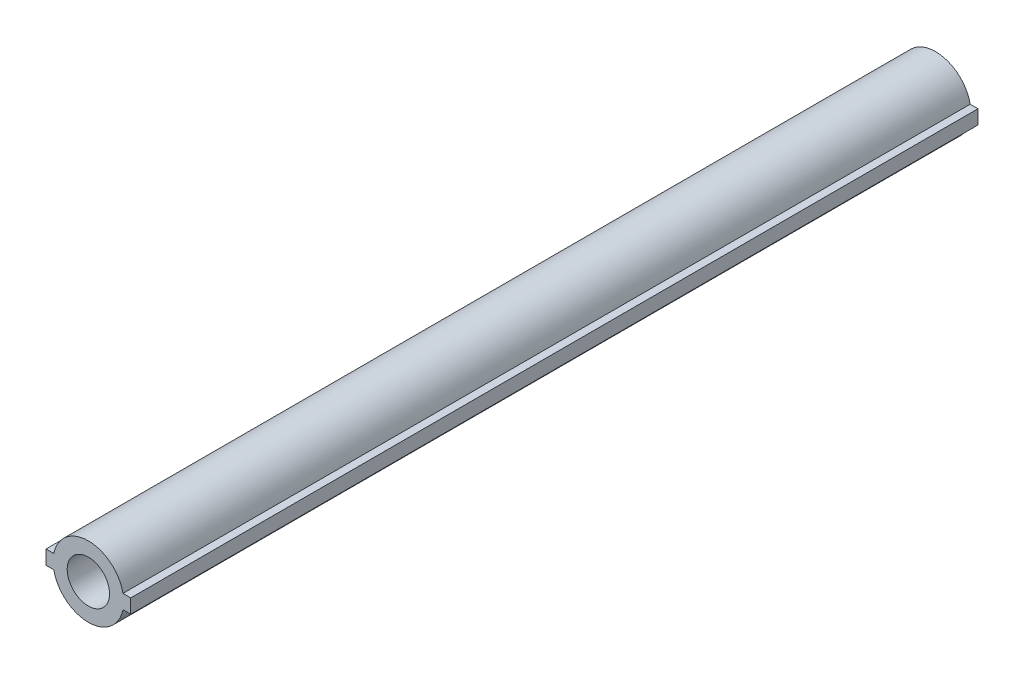
ISO-10303-21;
HEADER;
FILE_DESCRIPTION(('STEP AP214'),'2;1');
FILE_NAME('part.step','',(''),(''),'','','');
FILE_SCHEMA(('AUTOMOTIVE_DESIGN { 1 0 10303 214 1 1 1 1 }'));
ENDSEC;
DATA;
#1=APPLICATION_CONTEXT('core data for automotive mechanical design processes');
#2=APPLICATION_PROTOCOL_DEFINITION('international standard','automotive_design',2000,#1);
#3=PRODUCT_CONTEXT('',#1,'mechanical');
#4=PRODUCT('Part','Part','',(#3));
#5=PRODUCT_RELATED_PRODUCT_CATEGORY('part','',(#4));
#6=PRODUCT_DEFINITION_FORMATION('','',#4);
#7=PRODUCT_DEFINITION_CONTEXT('part definition',#1,'design');
#8=PRODUCT_DEFINITION('design','',#6,#7);
#9=PRODUCT_DEFINITION_SHAPE('','',#8);
#10=(LENGTH_UNIT() NAMED_UNIT(*) SI_UNIT(.MILLI.,.METRE.));
#11=(NAMED_UNIT(*) PLANE_ANGLE_UNIT() SI_UNIT($,.RADIAN.));
#12=(NAMED_UNIT(*) SI_UNIT($,.STERADIAN.) SOLID_ANGLE_UNIT());
#13=UNCERTAINTY_MEASURE_WITH_UNIT(LENGTH_MEASURE(1.E-05),#10,'distance_accuracy_value','');
#14=(GEOMETRIC_REPRESENTATION_CONTEXT(3) GLOBAL_UNCERTAINTY_ASSIGNED_CONTEXT((#13)) GLOBAL_UNIT_ASSIGNED_CONTEXT((#10,
#11,#12)) REPRESENTATION_CONTEXT('',''));
#15=CARTESIAN_POINT('',(0.,0.,0.));
#16=DIRECTION('',(0.,0.,1.));
#17=DIRECTION('',(1.,0.,0.));
#18=AXIS2_PLACEMENT_3D('',#15,#16,#17);
#19=CARTESIAN_POINT('',(0.,0.,18000.));
#20=DIRECTION('',(0.,0.,-1.));
#21=DIRECTION('',(-1.,0.,0.));
#22=AXIS2_PLACEMENT_3D('',#19,#20,#21);
#23=CYLINDRICAL_SURFACE('',#22,750.);
#24=CARTESIAN_POINT('',(0.,0.,18000.));
#25=DIRECTION('',(0.,0.,1.));
#26=DIRECTION('',(1.,0.,0.));
#27=AXIS2_PLACEMENT_3D('',#24,#25,#26);
#28=CIRCLE('',#27,750.);
#29=CARTESIAN_POINT('',(-734.846922834953,-150.,18000.));
#30=VERTEX_POINT('',#29);
#31=CARTESIAN_POINT('',(734.846922834953,-150.,18000.));
#32=VERTEX_POINT('',#31);
#33=EDGE_CURVE('E51',#30,#32,#28,.T.);
#34=ORIENTED_EDGE('',*,*,#33,.F.);
#35=DIRECTION('',(0.,0.,-1.));
#36=VECTOR('',#35,1.);
#37=CARTESIAN_POINT('',(-734.846922834953,-150.,18000.));
#38=LINE('',#37,#36);
#39=CARTESIAN_POINT('',(-734.846922834953,-150.,0.));
#40=VERTEX_POINT('',#39);
#41=EDGE_CURVE('E165',#30,#40,#38,.T.);
#42=ORIENTED_EDGE('',*,*,#41,.T.);
#43=CARTESIAN_POINT('',(0.,0.,0.));
#44=DIRECTION('',(0.,0.,1.));
#45=DIRECTION('',(1.,0.,0.));
#46=AXIS2_PLACEMENT_3D('',#43,#44,#45);
#47=CIRCLE('',#46,750.);
#48=CARTESIAN_POINT('',(734.846922834953,-150.,0.));
#49=VERTEX_POINT('',#48);
#50=EDGE_CURVE('E167',#40,#49,#47,.T.);
#51=ORIENTED_EDGE('',*,*,#50,.T.);
#52=DIRECTION('',(0.,0.,-1.));
#53=VECTOR('',#52,1.);
#54=CARTESIAN_POINT('',(734.846922834953,-150.,18000.));
#55=LINE('',#54,#53);
#56=EDGE_CURVE('E162',#49,#32,#55,.F.);
#57=ORIENTED_EDGE('',*,*,#56,.T.);
#58=EDGE_LOOP('',(#34,#42,#51,#57));
#59=FACE_BOUND('',#58,.T.);
#60=ADVANCED_FACE('F42',(#59),#23,.T.);
#61=CARTESIAN_POINT('',(734.846922834953,150.,18000.));
#62=VERTEX_POINT('',#61);
#63=CARTESIAN_POINT('',(-734.846922834953,150.,18000.));
#64=VERTEX_POINT('',#63);
#65=EDGE_CURVE('E11',#62,#64,#28,.T.);
#66=ORIENTED_EDGE('',*,*,#65,.F.);
#67=DIRECTION('',(0.,0.,-1.));
#68=VECTOR('',#67,1.);
#69=CARTESIAN_POINT('',(734.846922834953,150.,18000.));
#70=LINE('',#69,#68);
#71=CARTESIAN_POINT('',(734.846922834953,150.,0.));
#72=VERTEX_POINT('',#71);
#73=EDGE_CURVE('E160',#62,#72,#70,.T.);
#74=ORIENTED_EDGE('',*,*,#73,.T.);
#75=CARTESIAN_POINT('',(-734.846922834953,150.,0.));
#76=VERTEX_POINT('',#75);
#77=EDGE_CURVE('E46',#72,#76,#47,.T.);
#78=ORIENTED_EDGE('',*,*,#77,.T.);
#79=DIRECTION('',(0.,0.,-1.));
#80=VECTOR('',#79,1.);
#81=CARTESIAN_POINT('',(-734.846922834953,150.,18000.));
#82=LINE('',#81,#80);
#83=EDGE_CURVE('E153',#76,#64,#82,.F.);
#84=ORIENTED_EDGE('',*,*,#83,.T.);
#85=EDGE_LOOP('',(#66,#74,#78,#84));
#86=FACE_BOUND('',#85,.T.);
#87=ADVANCED_FACE('F44',(#86),#23,.T.);
#88=CARTESIAN_POINT('',(0.,0.,18000.));
#89=DIRECTION('',(0.,0.,1.));
#90=DIRECTION('',(1.,0.,0.));
#91=AXIS2_PLACEMENT_3D('',#88,#89,#90);
#92=PLANE('',#91);
#93=CARTESIAN_POINT('',(0.,0.,18000.));
#94=DIRECTION('',(0.,0.,-1.));
#95=DIRECTION('',(-1.,0.,0.));
#96=AXIS2_PLACEMENT_3D('',#93,#94,#95);
#97=CIRCLE('',#96,450.);
#98=CARTESIAN_POINT('',(-450.,0.,18000.));
#99=VERTEX_POINT('',#98);
#100=EDGE_CURVE('E138',#99,#99,#97,.T.);
#101=ORIENTED_EDGE('',*,*,#100,.T.);
#102=EDGE_LOOP('',(#101));
#103=FACE_BOUND('',#102,.T.);
#104=ORIENTED_EDGE('',*,*,#65,.T.);
#105=DIRECTION('',(-1.,0.,0.));
#106=VECTOR('',#105,1.);
#107=CARTESIAN_POINT('',(-900.,150.,18000.));
#108=LINE('',#107,#106);
#109=CARTESIAN_POINT('',(-900.,150.,18000.));
#110=VERTEX_POINT('',#109);
#111=EDGE_CURVE('E147',#64,#110,#108,.T.);
#112=ORIENTED_EDGE('',*,*,#111,.T.);
#113=DIRECTION('',(0.,-1.,0.));
#114=VECTOR('',#113,1.);
#115=CARTESIAN_POINT('',(-900.,-150.,18000.));
#116=LINE('',#115,#114);
#117=CARTESIAN_POINT('',(-900.,-150.,18000.));
#118=VERTEX_POINT('',#117);
#119=EDGE_CURVE('E150',#110,#118,#116,.T.);
#120=ORIENTED_EDGE('',*,*,#119,.T.);
#121=DIRECTION('',(1.,0.,0.));
#122=VECTOR('',#121,1.);
#123=CARTESIAN_POINT('',(-900.,-150.,18000.));
#124=LINE('',#123,#122);
#125=EDGE_CURVE('E58',#118,#30,#124,.T.);
#126=ORIENTED_EDGE('',*,*,#125,.T.);
#127=ORIENTED_EDGE('',*,*,#33,.T.);
#128=CARTESIAN_POINT('',(900.,-150.,18000.));
#129=VERTEX_POINT('',#128);
#130=EDGE_CURVE('E135',#32,#129,#124,.T.);
#131=ORIENTED_EDGE('',*,*,#130,.T.);
#132=DIRECTION('',(0.,1.,0.));
#133=VECTOR('',#132,1.);
#134=CARTESIAN_POINT('',(900.,-150.,18000.));
#135=LINE('',#134,#133);
#136=CARTESIAN_POINT('',(900.,150.,18000.));
#137=VERTEX_POINT('',#136);
#138=EDGE_CURVE('E145',#129,#137,#135,.T.);
#139=ORIENTED_EDGE('',*,*,#138,.T.);
#140=EDGE_CURVE('E64',#137,#62,#108,.T.);
#141=ORIENTED_EDGE('',*,*,#140,.T.);
#142=EDGE_LOOP('',(#104,#112,#120,#126,#127,#131,#139,#141));
#143=FACE_BOUND('',#142,.T.);
#144=ADVANCED_FACE('F173',(#103,#143),#92,.T.);
#145=CARTESIAN_POINT('',(0.,0.,0.));
#146=DIRECTION('',(0.,0.,1.));
#147=DIRECTION('',(1.,0.,0.));
#148=AXIS2_PLACEMENT_3D('',#145,#146,#147);
#149=PLANE('',#148);
#150=ORIENTED_EDGE('',*,*,#77,.F.);
#151=DIRECTION('',(-1.,0.,0.));
#152=VECTOR('',#151,1.);
#153=CARTESIAN_POINT('',(-900.,150.,0.));
#154=LINE('',#153,#152);
#155=CARTESIAN_POINT('',(900.,150.,0.));
#156=VERTEX_POINT('',#155);
#157=EDGE_CURVE('E111',#156,#72,#154,.T.);
#158=ORIENTED_EDGE('',*,*,#157,.F.);
#159=DIRECTION('',(0.,1.,0.));
#160=VECTOR('',#159,1.);
#161=CARTESIAN_POINT('',(900.,-150.,0.));
#162=LINE('',#161,#160);
#163=CARTESIAN_POINT('',(900.,-150.,0.));
#164=VERTEX_POINT('',#163);
#165=EDGE_CURVE('E124',#164,#156,#162,.T.);
#166=ORIENTED_EDGE('',*,*,#165,.F.);
#167=DIRECTION('',(1.,0.,0.));
#168=VECTOR('',#167,1.);
#169=CARTESIAN_POINT('',(-900.,-150.,0.));
#170=LINE('',#169,#168);
#171=EDGE_CURVE('E143',#49,#164,#170,.T.);
#172=ORIENTED_EDGE('',*,*,#171,.F.);
#173=ORIENTED_EDGE('',*,*,#50,.F.);
#174=CARTESIAN_POINT('',(-900.,-150.,0.));
#175=VERTEX_POINT('',#174);
#176=EDGE_CURVE('E117',#175,#40,#170,.T.);
#177=ORIENTED_EDGE('',*,*,#176,.F.);
#178=DIRECTION('',(0.,-1.,0.));
#179=VECTOR('',#178,1.);
#180=CARTESIAN_POINT('',(-900.,-150.,0.));
#181=LINE('',#180,#179);
#182=CARTESIAN_POINT('',(-900.,150.,0.));
#183=VERTEX_POINT('',#182);
#184=EDGE_CURVE('E127',#183,#175,#181,.T.);
#185=ORIENTED_EDGE('',*,*,#184,.F.);
#186=EDGE_CURVE('E128',#76,#183,#154,.T.);
#187=ORIENTED_EDGE('',*,*,#186,.F.);
#188=EDGE_LOOP('',(#150,#158,#166,#172,#173,#177,#185,#187));
#189=FACE_BOUND('',#188,.T.);
#190=ADVANCED_FACE('F122',(#189),#149,.F.);
#191=CARTESIAN_POINT('',(-900.,-150.,0.));
#192=DIRECTION('',(-1.,0.,0.));
#193=DIRECTION('',(0.,0.,1.));
#194=AXIS2_PLACEMENT_3D('',#191,#192,#193);
#195=PLANE('',#194);
#196=ORIENTED_EDGE('',*,*,#119,.F.);
#197=DIRECTION('',(0.,0.,1.));
#198=VECTOR('',#197,1.);
#199=CARTESIAN_POINT('',(-900.,150.,0.));
#200=LINE('',#199,#198);
#201=EDGE_CURVE('E116',#183,#110,#200,.T.);
#202=ORIENTED_EDGE('',*,*,#201,.F.);
#203=ORIENTED_EDGE('',*,*,#184,.T.);
#204=DIRECTION('',(0.,0.,1.));
#205=VECTOR('',#204,1.);
#206=CARTESIAN_POINT('',(-900.,-150.,0.));
#207=LINE('',#206,#205);
#208=EDGE_CURVE('E154',#175,#118,#207,.T.);
#209=ORIENTED_EDGE('',*,*,#208,.T.);
#210=EDGE_LOOP('',(#196,#202,#203,#209));
#211=FACE_BOUND('',#210,.T.);
#212=ADVANCED_FACE('F183',(#211),#195,.T.);
#213=CARTESIAN_POINT('',(-900.,150.,0.));
#214=DIRECTION('',(0.,1.,0.));
#215=DIRECTION('',(0.,0.,1.));
#216=AXIS2_PLACEMENT_3D('',#213,#214,#215);
#217=PLANE('',#216);
#218=ORIENTED_EDGE('',*,*,#83,.F.);
#219=ORIENTED_EDGE('',*,*,#186,.T.);
#220=ORIENTED_EDGE('',*,*,#201,.T.);
#221=ORIENTED_EDGE('',*,*,#111,.F.);
#222=EDGE_LOOP('',(#218,#219,#220,#221));
#223=FACE_BOUND('',#222,.T.);
#224=ADVANCED_FACE('F185',(#223),#217,.T.);
#225=CARTESIAN_POINT('',(-900.,-150.,0.));
#226=DIRECTION('',(0.,-1.,0.));
#227=DIRECTION('',(0.,0.,-1.));
#228=AXIS2_PLACEMENT_3D('',#225,#226,#227);
#229=PLANE('',#228);
#230=ORIENTED_EDGE('',*,*,#41,.F.);
#231=ORIENTED_EDGE('',*,*,#125,.F.);
#232=ORIENTED_EDGE('',*,*,#208,.F.);
#233=ORIENTED_EDGE('',*,*,#176,.T.);
#234=EDGE_LOOP('',(#230,#231,#232,#233));
#235=FACE_BOUND('',#234,.T.);
#236=ADVANCED_FACE('F179',(#235),#229,.T.);
#237=ORIENTED_EDGE('',*,*,#56,.F.);
#238=ORIENTED_EDGE('',*,*,#171,.T.);
#239=DIRECTION('',(0.,0.,1.));
#240=VECTOR('',#239,1.);
#241=CARTESIAN_POINT('',(900.,-150.,0.));
#242=LINE('',#241,#240);
#243=EDGE_CURVE('E133',#164,#129,#242,.T.);
#244=ORIENTED_EDGE('',*,*,#243,.T.);
#245=ORIENTED_EDGE('',*,*,#130,.F.);
#246=EDGE_LOOP('',(#237,#238,#244,#245));
#247=FACE_BOUND('',#246,.T.);
#248=ADVANCED_FACE('F175',(#247),#229,.T.);
#249=ORIENTED_EDGE('',*,*,#73,.F.);
#250=ORIENTED_EDGE('',*,*,#140,.F.);
#251=DIRECTION('',(0.,0.,1.));
#252=VECTOR('',#251,1.);
#253=CARTESIAN_POINT('',(900.,150.,0.));
#254=LINE('',#253,#252);
#255=EDGE_CURVE('E108',#156,#137,#254,.T.);
#256=ORIENTED_EDGE('',*,*,#255,.F.);
#257=ORIENTED_EDGE('',*,*,#157,.T.);
#258=EDGE_LOOP('',(#249,#250,#256,#257));
#259=FACE_BOUND('',#258,.T.);
#260=ADVANCED_FACE('F110',(#259),#217,.T.);
#261=CARTESIAN_POINT('',(900.,-150.,0.));
#262=DIRECTION('',(1.,0.,0.));
#263=DIRECTION('',(0.,1.,0.));
#264=AXIS2_PLACEMENT_3D('',#261,#262,#263);
#265=PLANE('',#264);
#266=ORIENTED_EDGE('',*,*,#138,.F.);
#267=ORIENTED_EDGE('',*,*,#243,.F.);
#268=ORIENTED_EDGE('',*,*,#165,.T.);
#269=ORIENTED_EDGE('',*,*,#255,.T.);
#270=EDGE_LOOP('',(#266,#267,#268,#269));
#271=FACE_BOUND('',#270,.T.);
#272=ADVANCED_FACE('F131',(#271),#265,.T.);
#273=CARTESIAN_POINT('',(0.,0.,6000.));
#274=DIRECTION('',(0.,0.,1.));
#275=DIRECTION('',(1.,0.,0.));
#276=AXIS2_PLACEMENT_3D('',#273,#274,#275);
#277=CYLINDRICAL_SURFACE('',#276,450.);
#278=CARTESIAN_POINT('',(0.,0.,6000.));
#279=DIRECTION('',(0.,0.,-1.));
#280=DIRECTION('',(-1.,0.,0.));
#281=AXIS2_PLACEMENT_3D('',#278,#279,#280);
#282=CIRCLE('',#281,450.);
#283=CARTESIAN_POINT('',(-450.,0.,6000.));
#284=VERTEX_POINT('',#283);
#285=EDGE_CURVE('E148',#284,#284,#282,.T.);
#286=ORIENTED_EDGE('',*,*,#285,.T.);
#287=EDGE_LOOP('',(#286));
#288=FACE_BOUND('',#287,.T.);
#289=ORIENTED_EDGE('',*,*,#100,.F.);
#290=EDGE_LOOP('',(#289));
#291=FACE_BOUND('',#290,.T.);
#292=ADVANCED_FACE('F251',(#288,#291),#277,.F.);
#293=CARTESIAN_POINT('',(0.,0.,6000.));
#294=DIRECTION('',(0.,0.,-1.));
#295=DIRECTION('',(-1.,0.,0.));
#296=AXIS2_PLACEMENT_3D('',#293,#294,#295);
#297=PLANE('',#296);
#298=ORIENTED_EDGE('',*,*,#285,.F.);
#299=EDGE_LOOP('',(#298));
#300=FACE_BOUND('',#299,.T.);
#301=ADVANCED_FACE('F260',(#300),#297,.F.);
#302=CLOSED_SHELL('',(#60,#87,#144,#190,#212,#224,#236,#248,#260,#272,#292,#301));
#303=MANIFOLD_SOLID_BREP('B2',#302);
#304=ADVANCED_BREP_SHAPE_REPRESENTATION('',(#18,#303),#14);
#305=SHAPE_DEFINITION_REPRESENTATION(#9,#304);
ENDSEC;
END-ISO-10303-21;
